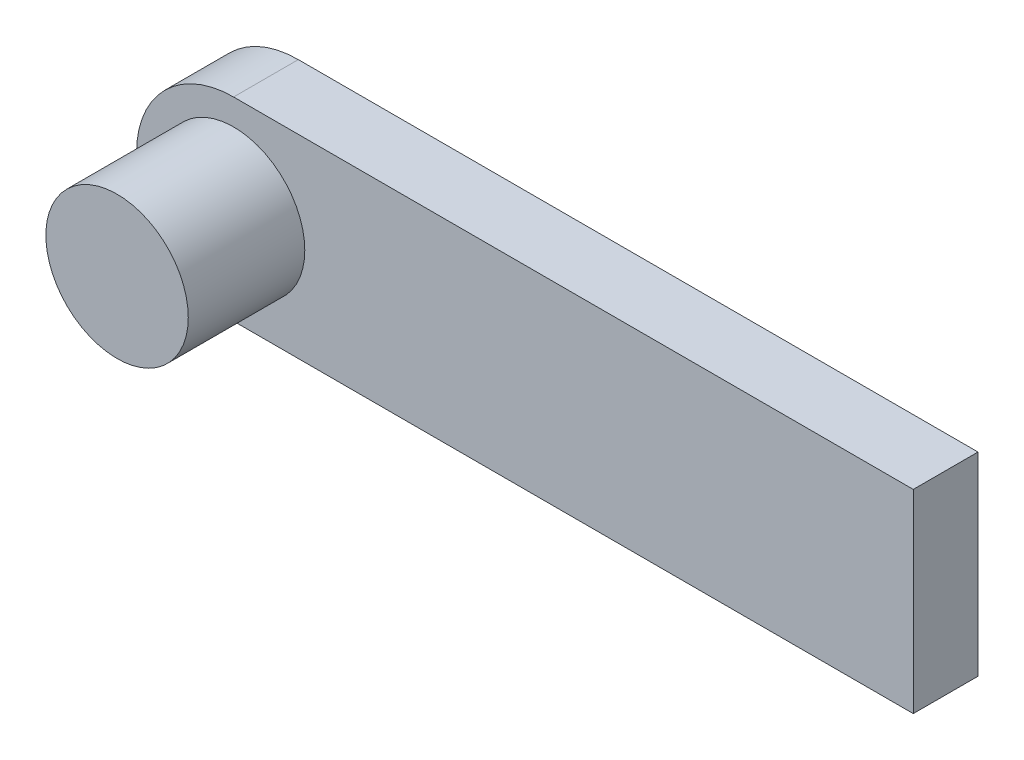
ISO-10303-21;
HEADER;
FILE_DESCRIPTION(('STEP AP214'),'2;1');
FILE_NAME('part.step','',(''),(''),'','','');
FILE_SCHEMA(('AUTOMOTIVE_DESIGN { 1 0 10303 214 1 1 1 1 }'));
ENDSEC;
DATA;
#1=APPLICATION_CONTEXT('core data for automotive mechanical design processes');
#2=APPLICATION_PROTOCOL_DEFINITION('international standard','automotive_design',2000,#1);
#3=PRODUCT_CONTEXT('',#1,'mechanical');
#4=PRODUCT('Part','Part','',(#3));
#5=PRODUCT_RELATED_PRODUCT_CATEGORY('part','',(#4));
#6=PRODUCT_DEFINITION_FORMATION('','',#4);
#7=PRODUCT_DEFINITION_CONTEXT('part definition',#1,'design');
#8=PRODUCT_DEFINITION('design','',#6,#7);
#9=PRODUCT_DEFINITION_SHAPE('','',#8);
#10=(LENGTH_UNIT() NAMED_UNIT(*) SI_UNIT(.MILLI.,.METRE.));
#11=(NAMED_UNIT(*) PLANE_ANGLE_UNIT() SI_UNIT($,.RADIAN.));
#12=(NAMED_UNIT(*) SI_UNIT($,.STERADIAN.) SOLID_ANGLE_UNIT());
#13=UNCERTAINTY_MEASURE_WITH_UNIT(LENGTH_MEASURE(1.E-05),#10,'distance_accuracy_value','');
#14=(GEOMETRIC_REPRESENTATION_CONTEXT(3) GLOBAL_UNCERTAINTY_ASSIGNED_CONTEXT((#13)) GLOBAL_UNIT_ASSIGNED_CONTEXT((#10,
#11,#12)) REPRESENTATION_CONTEXT('',''));
#15=CARTESIAN_POINT('',(0.,0.,0.));
#16=DIRECTION('',(0.,0.,1.));
#17=DIRECTION('',(1.,0.,0.));
#18=AXIS2_PLACEMENT_3D('',#15,#16,#17);
#19=CARTESIAN_POINT('',(0.,0.,0.25));
#20=DIRECTION('',(0.,0.,1.));
#21=DIRECTION('',(0.707106781186548,0.707106781186548,0.));
#22=AXIS2_PLACEMENT_3D('',#19,#20,#21);
#23=PLANE('',#22);
#24=DIRECTION('',(0.,1.,0.));
#25=VECTOR('',#24,1.);
#26=CARTESIAN_POINT('',(6.45,-0.375,0.25));
#27=LINE('',#26,#25);
#28=CARTESIAN_POINT('',(6.45,-0.375,0.25));
#29=VERTEX_POINT('',#28);
#30=CARTESIAN_POINT('',(6.45,0.375,0.25));
#31=VERTEX_POINT('',#30);
#32=EDGE_CURVE('E11',#29,#31,#27,.T.);
#33=ORIENTED_EDGE('',*,*,#32,.T.);
#34=DIRECTION('',(-1.,0.,0.));
#35=VECTOR('',#34,1.);
#36=CARTESIAN_POINT('',(6.45,0.375,0.25));
#37=LINE('',#36,#35);
#38=CARTESIAN_POINT('',(3.825,0.375,0.25));
#39=VERTEX_POINT('',#38);
#40=EDGE_CURVE('E26',#31,#39,#37,.T.);
#41=ORIENTED_EDGE('',*,*,#40,.T.);
#42=CARTESIAN_POINT('',(3.825,0.,0.25));
#43=DIRECTION('',(0.,0.,1.));
#44=DIRECTION('',(0.,1.,0.));
#45=AXIS2_PLACEMENT_3D('',#42,#43,#44);
#46=CIRCLE('',#45,0.375);
#47=CARTESIAN_POINT('',(3.825,-0.375,0.25));
#48=VERTEX_POINT('',#47);
#49=EDGE_CURVE('E104',#39,#48,#46,.T.);
#50=ORIENTED_EDGE('',*,*,#49,.T.);
#51=DIRECTION('',(1.,0.,0.));
#52=VECTOR('',#51,1.);
#53=CARTESIAN_POINT('',(3.825,-0.375,0.25));
#54=LINE('',#53,#52);
#55=EDGE_CURVE('E75',#48,#29,#54,.T.);
#56=ORIENTED_EDGE('',*,*,#55,.T.);
#57=EDGE_LOOP('',(#33,#41,#50,#56));
#58=FACE_BOUND('',#57,.T.);
#59=CARTESIAN_POINT('',(3.825,0.,0.25));
#60=DIRECTION('',(0.,0.,1.));
#61=DIRECTION('',(1.,0.,0.));
#62=AXIS2_PLACEMENT_3D('',#59,#60,#61);
#63=CIRCLE('',#62,0.275);
#64=CARTESIAN_POINT('',(4.1,0.,0.25));
#65=VERTEX_POINT('',#64);
#66=EDGE_CURVE('E66',#65,#65,#63,.T.);
#67=ORIENTED_EDGE('',*,*,#66,.F.);
#68=EDGE_LOOP('',(#67));
#69=FACE_BOUND('',#68,.T.);
#70=ADVANCED_FACE('F16',(#58,#69),#23,.T.);
#71=CARTESIAN_POINT('',(6.45,-0.375,0.));
#72=DIRECTION('',(1.,0.,0.));
#73=DIRECTION('',(0.,0.707106781186548,0.707106781186548));
#74=AXIS2_PLACEMENT_3D('',#71,#72,#73);
#75=PLANE('',#74);
#76=DIRECTION('',(0.,1.,0.));
#77=VECTOR('',#76,1.);
#78=CARTESIAN_POINT('',(6.45,-0.375,0.));
#79=LINE('',#78,#77);
#80=CARTESIAN_POINT('',(6.45,-0.375,0.));
#81=VERTEX_POINT('',#80);
#82=CARTESIAN_POINT('',(6.45,0.375,0.));
#83=VERTEX_POINT('',#82);
#84=EDGE_CURVE('E77',#81,#83,#79,.T.);
#85=ORIENTED_EDGE('',*,*,#84,.T.);
#86=DIRECTION('',(0.,0.,1.));
#87=VECTOR('',#86,1.);
#88=CARTESIAN_POINT('',(6.45,0.375,0.));
#89=LINE('',#88,#87);
#90=EDGE_CURVE('E80',#83,#31,#89,.T.);
#91=ORIENTED_EDGE('',*,*,#90,.T.);
#92=ORIENTED_EDGE('',*,*,#32,.F.);
#93=DIRECTION('',(0.,0.,1.));
#94=VECTOR('',#93,1.);
#95=CARTESIAN_POINT('',(6.45,-0.375,0.));
#96=LINE('',#95,#94);
#97=EDGE_CURVE('E68',#81,#29,#96,.T.);
#98=ORIENTED_EDGE('',*,*,#97,.F.);
#99=EDGE_LOOP('',(#85,#91,#92,#98));
#100=FACE_BOUND('',#99,.T.);
#101=ADVANCED_FACE('F98',(#100),#75,.T.);
#102=CARTESIAN_POINT('',(6.45,0.375,0.));
#103=DIRECTION('',(0.,1.,0.));
#104=DIRECTION('',(0.707106781186548,0.,0.707106781186548));
#105=AXIS2_PLACEMENT_3D('',#102,#103,#104);
#106=PLANE('',#105);
#107=DIRECTION('',(-1.,0.,0.));
#108=VECTOR('',#107,1.);
#109=CARTESIAN_POINT('',(6.45,0.375,0.));
#110=LINE('',#109,#108);
#111=CARTESIAN_POINT('',(3.825,0.375,0.));
#112=VERTEX_POINT('',#111);
#113=EDGE_CURVE('E82',#83,#112,#110,.T.);
#114=ORIENTED_EDGE('',*,*,#113,.T.);
#115=DIRECTION('',(0.,0.,1.));
#116=VECTOR('',#115,1.);
#117=CARTESIAN_POINT('',(3.825,0.375,0.));
#118=LINE('',#117,#116);
#119=EDGE_CURVE('E86',#112,#39,#118,.T.);
#120=ORIENTED_EDGE('',*,*,#119,.T.);
#121=ORIENTED_EDGE('',*,*,#40,.F.);
#122=ORIENTED_EDGE('',*,*,#90,.F.);
#123=EDGE_LOOP('',(#114,#120,#121,#122));
#124=FACE_BOUND('',#123,.T.);
#125=ADVANCED_FACE('F108',(#124),#106,.T.);
#126=CARTESIAN_POINT('',(3.825,0.,0.));
#127=DIRECTION('',(0.,0.,1.));
#128=DIRECTION('',(0.,1.,0.));
#129=AXIS2_PLACEMENT_3D('',#126,#127,#128);
#130=CYLINDRICAL_SURFACE('',#129,0.375);
#131=CARTESIAN_POINT('',(3.825,0.,0.));
#132=DIRECTION('',(0.,0.,1.));
#133=DIRECTION('',(0.,1.,0.));
#134=AXIS2_PLACEMENT_3D('',#131,#132,#133);
#135=CIRCLE('',#134,0.375);
#136=CARTESIAN_POINT('',(3.825,-0.375,0.));
#137=VERTEX_POINT('',#136);
#138=EDGE_CURVE('E88',#112,#137,#135,.T.);
#139=ORIENTED_EDGE('',*,*,#138,.T.);
#140=DIRECTION('',(0.,0.,1.));
#141=VECTOR('',#140,1.);
#142=CARTESIAN_POINT('',(3.825,-0.375,0.));
#143=LINE('',#142,#141);
#144=EDGE_CURVE('E58',#137,#48,#143,.T.);
#145=ORIENTED_EDGE('',*,*,#144,.T.);
#146=ORIENTED_EDGE('',*,*,#49,.F.);
#147=ORIENTED_EDGE('',*,*,#119,.F.);
#148=EDGE_LOOP('',(#139,#145,#146,#147));
#149=FACE_BOUND('',#148,.T.);
#150=ADVANCED_FACE('F107',(#149),#130,.T.);
#151=CARTESIAN_POINT('',(3.825,-0.375,0.));
#152=DIRECTION('',(0.,-1.,0.));
#153=DIRECTION('',(0.707106781186548,0.,0.707106781186548));
#154=AXIS2_PLACEMENT_3D('',#151,#152,#153);
#155=PLANE('',#154);
#156=DIRECTION('',(1.,0.,0.));
#157=VECTOR('',#156,1.);
#158=CARTESIAN_POINT('',(3.825,-0.375,0.));
#159=LINE('',#158,#157);
#160=EDGE_CURVE('E71',#137,#81,#159,.T.);
#161=ORIENTED_EDGE('',*,*,#160,.T.);
#162=ORIENTED_EDGE('',*,*,#97,.T.);
#163=ORIENTED_EDGE('',*,*,#55,.F.);
#164=ORIENTED_EDGE('',*,*,#144,.F.);
#165=EDGE_LOOP('',(#161,#162,#163,#164));
#166=FACE_BOUND('',#165,.T.);
#167=ADVANCED_FACE('F91',(#166),#155,.T.);
#168=CARTESIAN_POINT('',(3.825,0.,0.25));
#169=DIRECTION('',(0.,0.,1.));
#170=DIRECTION('',(1.,0.,0.));
#171=AXIS2_PLACEMENT_3D('',#168,#169,#170);
#172=CYLINDRICAL_SURFACE('',#171,0.275);
#173=CARTESIAN_POINT('',(3.825,0.,0.7));
#174=DIRECTION('',(0.,0.,1.));
#175=DIRECTION('',(1.,0.,0.));
#176=AXIS2_PLACEMENT_3D('',#173,#174,#175);
#177=CIRCLE('',#176,0.275);
#178=CARTESIAN_POINT('',(4.1,0.,0.7));
#179=VERTEX_POINT('',#178);
#180=EDGE_CURVE('E20',#179,#179,#177,.T.);
#181=ORIENTED_EDGE('',*,*,#180,.F.);
#182=EDGE_LOOP('',(#181));
#183=FACE_BOUND('',#182,.T.);
#184=ORIENTED_EDGE('',*,*,#66,.T.);
#185=EDGE_LOOP('',(#184));
#186=FACE_BOUND('',#185,.T.);
#187=ADVANCED_FACE('F63',(#183,#186),#172,.T.);
#188=CARTESIAN_POINT('',(0.,0.,0.));
#189=DIRECTION('',(0.,0.,1.));
#190=DIRECTION('',(0.707106781186548,0.707106781186548,0.));
#191=AXIS2_PLACEMENT_3D('',#188,#189,#190);
#192=PLANE('',#191);
#193=ORIENTED_EDGE('',*,*,#160,.F.);
#194=ORIENTED_EDGE('',*,*,#138,.F.);
#195=ORIENTED_EDGE('',*,*,#113,.F.);
#196=ORIENTED_EDGE('',*,*,#84,.F.);
#197=EDGE_LOOP('',(#193,#194,#195,#196));
#198=FACE_BOUND('',#197,.T.);
#199=ADVANCED_FACE('F95',(#198),#192,.F.);
#200=CARTESIAN_POINT('',(2.55,0.,0.7));
#201=DIRECTION('',(0.,0.,-1.));
#202=DIRECTION('',(0.707106781186548,0.707106781186548,0.));
#203=AXIS2_PLACEMENT_3D('',#200,#201,#202);
#204=PLANE('',#203);
#205=ORIENTED_EDGE('',*,*,#180,.T.);
#206=EDGE_LOOP('',(#205));
#207=FACE_BOUND('',#206,.T.);
#208=ADVANCED_FACE('F18',(#207),#204,.F.);
#209=CLOSED_SHELL('',(#70,#101,#125,#150,#167,#187,#199,#208));
#210=MANIFOLD_SOLID_BREP('B1',#209);
#211=ADVANCED_BREP_SHAPE_REPRESENTATION('',(#18,#210),#14);
#212=SHAPE_DEFINITION_REPRESENTATION(#9,#211);
ENDSEC;
END-ISO-10303-21;
